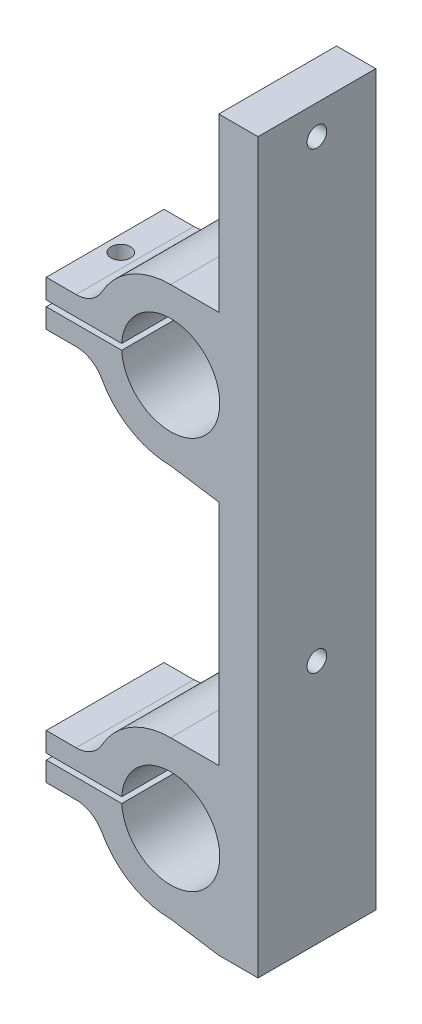
ISO-10303-21;
HEADER;
FILE_DESCRIPTION(('STEP AP214'),'2;1');
FILE_NAME('part.step','',(''),(''),'','','');
FILE_SCHEMA(('AUTOMOTIVE_DESIGN { 1 0 10303 214 1 1 1 1 }'));
ENDSEC;
DATA;
#1=APPLICATION_CONTEXT('core data for automotive mechanical design processes');
#2=APPLICATION_PROTOCOL_DEFINITION('international standard','automotive_design',2000,#1);
#3=PRODUCT_CONTEXT('',#1,'mechanical');
#4=PRODUCT('Part','Part','',(#3));
#5=PRODUCT_RELATED_PRODUCT_CATEGORY('part','',(#4));
#6=PRODUCT_DEFINITION_FORMATION('','',#4);
#7=PRODUCT_DEFINITION_CONTEXT('part definition',#1,'design');
#8=PRODUCT_DEFINITION('design','',#6,#7);
#9=PRODUCT_DEFINITION_SHAPE('','',#8);
#10=(LENGTH_UNIT() NAMED_UNIT(*) SI_UNIT(.MILLI.,.METRE.));
#11=(NAMED_UNIT(*) PLANE_ANGLE_UNIT() SI_UNIT($,.RADIAN.));
#12=(NAMED_UNIT(*) SI_UNIT($,.STERADIAN.) SOLID_ANGLE_UNIT());
#13=UNCERTAINTY_MEASURE_WITH_UNIT(LENGTH_MEASURE(1.E-05),#10,'distance_accuracy_value','');
#14=(GEOMETRIC_REPRESENTATION_CONTEXT(3) GLOBAL_UNCERTAINTY_ASSIGNED_CONTEXT((#13)) GLOBAL_UNIT_ASSIGNED_CONTEXT((#10,
#11,#12)) REPRESENTATION_CONTEXT('',''));
#15=CARTESIAN_POINT('',(0.,0.,0.));
#16=DIRECTION('',(0.,0.,1.));
#17=DIRECTION('',(1.,0.,0.));
#18=AXIS2_PLACEMENT_3D('',#15,#16,#17);
#19=CARTESIAN_POINT('',(-9.63898334888073,-5.3,12.));
#20=DIRECTION('',(0.,0.,-1.));
#21=DIRECTION('',(-1.,0.,0.));
#22=AXIS2_PLACEMENT_3D('',#19,#20,#21);
#23=CYLINDRICAL_SURFACE('',#22,3.);
#24=CARTESIAN_POINT('',(-9.63898334888073,-5.3,0.));
#25=DIRECTION('',(0.,0.,-1.));
#26=DIRECTION('',(-1.,0.,0.));
#27=AXIS2_PLACEMENT_3D('',#24,#25,#26);
#28=CIRCLE('',#27,3.);
#29=CARTESIAN_POINT('',(-9.63898334888073,-2.3,0.));
#30=VERTEX_POINT('',#29);
#31=CARTESIAN_POINT('',(-7.0101697082769,-3.85454545454545,0.));
#32=VERTEX_POINT('',#31);
#33=EDGE_CURVE('E270',#30,#32,#28,.T.);
#34=ORIENTED_EDGE('',*,*,#33,.T.);
#35=DIRECTION('',(0.,0.,-1.));
#36=VECTOR('',#35,1.);
#37=CARTESIAN_POINT('',(-7.0101697082769,-3.85454545454545,12.));
#38=LINE('',#37,#36);
#39=CARTESIAN_POINT('',(-7.0101697082769,-3.85454545454545,12.));
#40=VERTEX_POINT('',#39);
#41=EDGE_CURVE('E11',#40,#32,#38,.T.);
#42=ORIENTED_EDGE('',*,*,#41,.F.);
#43=CARTESIAN_POINT('',(-9.63898334888073,-5.3,12.));
#44=DIRECTION('',(0.,0.,-1.));
#45=DIRECTION('',(-1.,0.,0.));
#46=AXIS2_PLACEMENT_3D('',#43,#44,#45);
#47=CIRCLE('',#46,3.);
#48=CARTESIAN_POINT('',(-9.63898334888073,-2.3,12.));
#49=VERTEX_POINT('',#48);
#50=EDGE_CURVE('E332',#49,#40,#47,.T.);
#51=ORIENTED_EDGE('',*,*,#50,.F.);
#52=DIRECTION('',(0.,0.,-1.));
#53=VECTOR('',#52,1.);
#54=CARTESIAN_POINT('',(-9.63898334888073,-2.3,12.));
#55=LINE('',#54,#53);
#56=EDGE_CURVE('E266',#49,#30,#55,.T.);
#57=ORIENTED_EDGE('',*,*,#56,.T.);
#58=EDGE_LOOP('',(#34,#42,#51,#57));
#59=FACE_BOUND('',#58,.T.);
#60=ADVANCED_FACE('F35',(#59),#23,.F.);
#61=CARTESIAN_POINT('',(0.,0.,12.));
#62=DIRECTION('',(0.,0.,-1.));
#63=DIRECTION('',(-1.,0.,0.));
#64=AXIS2_PLACEMENT_3D('',#61,#62,#63);
#65=CYLINDRICAL_SURFACE('',#64,8.);
#66=CARTESIAN_POINT('',(0.,0.,0.));
#67=DIRECTION('',(0.,0.,1.));
#68=DIRECTION('',(1.,0.,0.));
#69=AXIS2_PLACEMENT_3D('',#66,#67,#68);
#70=CIRCLE('',#69,8.);
#71=CARTESIAN_POINT('',(0.,-8.,0.));
#72=VERTEX_POINT('',#71);
#73=EDGE_CURVE('E273',#32,#72,#70,.T.);
#74=ORIENTED_EDGE('',*,*,#73,.T.);
#75=DIRECTION('',(0.,0.,-1.));
#76=VECTOR('',#75,1.);
#77=CARTESIAN_POINT('',(0.,-8.,12.));
#78=LINE('',#77,#76);
#79=CARTESIAN_POINT('',(0.,-8.,12.));
#80=VERTEX_POINT('',#79);
#81=EDGE_CURVE('E44',#80,#72,#78,.T.);
#82=ORIENTED_EDGE('',*,*,#81,.F.);
#83=CARTESIAN_POINT('',(0.,0.,12.));
#84=DIRECTION('',(0.,0.,1.));
#85=DIRECTION('',(1.,0.,0.));
#86=AXIS2_PLACEMENT_3D('',#83,#84,#85);
#87=CIRCLE('',#86,8.);
#88=EDGE_CURVE('E164',#40,#80,#87,.T.);
#89=ORIENTED_EDGE('',*,*,#88,.F.);
#90=ORIENTED_EDGE('',*,*,#41,.T.);
#91=EDGE_LOOP('',(#74,#82,#89,#90));
#92=FACE_BOUND('',#91,.T.);
#93=ADVANCED_FACE('F507',(#92),#65,.T.);
#94=CARTESIAN_POINT('',(0.,-8.,12.));
#95=DIRECTION('',(0.152092330302128,0.988366289926598,0.));
#96=DIRECTION('',(-0.988366289926598,0.152092330302128,0.));
#97=AXIS2_PLACEMENT_3D('',#94,#95,#96);
#98=PLANE('',#97);
#99=DIRECTION('',(0.988366289926598,-0.152092330302128,0.));
#100=VECTOR('',#99,1.);
#101=CARTESIAN_POINT('',(0.,-8.,0.));
#102=LINE('',#101,#100);
#103=CARTESIAN_POINT('',(4.9,-8.7540245211477,0.));
#104=VERTEX_POINT('',#103);
#105=EDGE_CURVE('E276',#72,#104,#102,.T.);
#106=ORIENTED_EDGE('',*,*,#105,.T.);
#107=DIRECTION('',(0.,0.,-1.));
#108=VECTOR('',#107,1.);
#109=CARTESIAN_POINT('',(4.9,-8.7540245211477,12.));
#110=LINE('',#109,#108);
#111=CARTESIAN_POINT('',(4.9,-8.7540245211477,12.));
#112=VERTEX_POINT('',#111);
#113=EDGE_CURVE('E408',#112,#104,#110,.T.);
#114=ORIENTED_EDGE('',*,*,#113,.F.);
#115=DIRECTION('',(0.988366289926598,-0.152092330302128,0.));
#116=VECTOR('',#115,1.);
#117=CARTESIAN_POINT('',(0.,-8.,12.));
#118=LINE('',#117,#116);
#119=EDGE_CURVE('E417',#80,#112,#118,.T.);
#120=ORIENTED_EDGE('',*,*,#119,.F.);
#121=ORIENTED_EDGE('',*,*,#81,.T.);
#122=EDGE_LOOP('',(#106,#114,#120,#121));
#123=FACE_BOUND('',#122,.T.);
#124=ADVANCED_FACE('F415',(#123),#98,.F.);
#125=CARTESIAN_POINT('',(4.9,-31.,12.));
#126=DIRECTION('',(1.,0.,0.));
#127=DIRECTION('',(0.,1.,0.));
#128=AXIS2_PLACEMENT_3D('',#125,#126,#127);
#129=PLANE('',#128);
#130=CARTESIAN_POINT('',(4.9,-23.78,6.));
#131=DIRECTION('',(-1.,0.,0.));
#132=DIRECTION('',(0.,0.,1.));
#133=AXIS2_PLACEMENT_3D('',#130,#131,#132);
#134=CIRCLE('',#133,1.);
#135=CARTESIAN_POINT('',(4.9,-23.78,7.));
#136=VERTEX_POINT('',#135);
#137=EDGE_CURVE('E621',#136,#136,#134,.T.);
#138=ORIENTED_EDGE('',*,*,#137,.F.);
#139=EDGE_LOOP('',(#138));
#140=FACE_BOUND('',#139,.T.);
#141=DIRECTION('',(0.,-1.,0.));
#142=VECTOR('',#141,1.);
#143=CARTESIAN_POINT('',(4.9,-31.,0.));
#144=LINE('',#143,#142);
#145=CARTESIAN_POINT('',(4.9,-32.,0.));
#146=VERTEX_POINT('',#145);
#147=EDGE_CURVE('E279',#104,#146,#144,.T.);
#148=ORIENTED_EDGE('',*,*,#147,.T.);
#149=DIRECTION('',(0.,0.,-1.));
#150=VECTOR('',#149,1.);
#151=CARTESIAN_POINT('',(4.9,-32.,12.));
#152=LINE('',#151,#150);
#153=CARTESIAN_POINT('',(4.9,-32.,12.));
#154=VERTEX_POINT('',#153);
#155=EDGE_CURVE('E405',#154,#146,#152,.T.);
#156=ORIENTED_EDGE('',*,*,#155,.F.);
#157=DIRECTION('',(0.,-1.,0.));
#158=VECTOR('',#157,1.);
#159=CARTESIAN_POINT('',(4.9,-8.7540245211477,12.));
#160=LINE('',#159,#158);
#161=EDGE_CURVE('E434',#112,#154,#160,.T.);
#162=ORIENTED_EDGE('',*,*,#161,.F.);
#163=ORIENTED_EDGE('',*,*,#113,.T.);
#164=EDGE_LOOP('',(#148,#156,#162,#163));
#165=FACE_BOUND('',#164,.T.);
#166=ADVANCED_FACE('F425',(#140,#165),#129,.F.);
#167=CARTESIAN_POINT('',(0.,-32.,12.));
#168=DIRECTION('',(0.,-1.,0.));
#169=DIRECTION('',(1.,0.,0.));
#170=AXIS2_PLACEMENT_3D('',#167,#168,#169);
#171=PLANE('',#170);
#172=DIRECTION('',(-1.,0.,0.));
#173=VECTOR('',#172,1.);
#174=CARTESIAN_POINT('',(0.,-32.,0.));
#175=LINE('',#174,#173);
#176=CARTESIAN_POINT('',(0.,-32.,0.));
#177=VERTEX_POINT('',#176);
#178=EDGE_CURVE('E281',#146,#177,#175,.T.);
#179=ORIENTED_EDGE('',*,*,#178,.T.);
#180=DIRECTION('',(0.,0.,-1.));
#181=VECTOR('',#180,1.);
#182=CARTESIAN_POINT('',(0.,-32.,12.));
#183=LINE('',#182,#181);
#184=CARTESIAN_POINT('',(0.,-32.,12.));
#185=VERTEX_POINT('',#184);
#186=EDGE_CURVE('E402',#185,#177,#183,.T.);
#187=ORIENTED_EDGE('',*,*,#186,.F.);
#188=DIRECTION('',(-1.,0.,0.));
#189=VECTOR('',#188,1.);
#190=CARTESIAN_POINT('',(0.,-32.,12.));
#191=LINE('',#190,#189);
#192=EDGE_CURVE('E431',#154,#185,#191,.T.);
#193=ORIENTED_EDGE('',*,*,#192,.F.);
#194=ORIENTED_EDGE('',*,*,#155,.T.);
#195=EDGE_LOOP('',(#179,#187,#193,#194));
#196=FACE_BOUND('',#195,.T.);
#197=ADVANCED_FACE('F429',(#196),#171,.F.);
#198=CARTESIAN_POINT('',(0.,-40.,12.));
#199=DIRECTION('',(0.,0.,-1.));
#200=DIRECTION('',(-1.,0.,0.));
#201=AXIS2_PLACEMENT_3D('',#198,#199,#200);
#202=CYLINDRICAL_SURFACE('',#201,8.);
#203=CARTESIAN_POINT('',(0.,-40.,0.));
#204=DIRECTION('',(0.,0.,1.));
#205=DIRECTION('',(1.,0.,0.));
#206=AXIS2_PLACEMENT_3D('',#203,#204,#205);
#207=CIRCLE('',#206,8.);
#208=CARTESIAN_POINT('',(-7.01016970827689,-36.1454545454545,0.));
#209=VERTEX_POINT('',#208);
#210=EDGE_CURVE('E283',#177,#209,#207,.T.);
#211=ORIENTED_EDGE('',*,*,#210,.T.);
#212=DIRECTION('',(0.,0.,-1.));
#213=VECTOR('',#212,1.);
#214=CARTESIAN_POINT('',(-7.01016970827689,-36.1454545454545,12.));
#215=LINE('',#214,#213);
#216=CARTESIAN_POINT('',(-7.01016970827689,-36.1454545454545,12.));
#217=VERTEX_POINT('',#216);
#218=EDGE_CURVE('E399',#217,#209,#215,.T.);
#219=ORIENTED_EDGE('',*,*,#218,.F.);
#220=CARTESIAN_POINT('',(0.,-40.,12.));
#221=DIRECTION('',(0.,0.,1.));
#222=DIRECTION('',(1.,0.,0.));
#223=AXIS2_PLACEMENT_3D('',#220,#221,#222);
#224=CIRCLE('',#223,8.);
#225=EDGE_CURVE('E433',#185,#217,#224,.T.);
#226=ORIENTED_EDGE('',*,*,#225,.F.);
#227=ORIENTED_EDGE('',*,*,#186,.T.);
#228=EDGE_LOOP('',(#211,#219,#226,#227));
#229=FACE_BOUND('',#228,.T.);
#230=ADVANCED_FACE('F521',(#229),#202,.T.);
#231=CARTESIAN_POINT('',(-9.63898334888073,-34.7,12.));
#232=DIRECTION('',(0.,0.,-1.));
#233=DIRECTION('',(-1.,0.,0.));
#234=AXIS2_PLACEMENT_3D('',#231,#232,#233);
#235=CYLINDRICAL_SURFACE('',#234,3.);
#236=CARTESIAN_POINT('',(-9.63898334888073,-34.7,0.));
#237=DIRECTION('',(0.,0.,-1.));
#238=DIRECTION('',(1.,0.,0.));
#239=AXIS2_PLACEMENT_3D('',#236,#237,#238);
#240=CIRCLE('',#239,3.);
#241=CARTESIAN_POINT('',(-9.63898334888073,-37.7,0.));
#242=VERTEX_POINT('',#241);
#243=EDGE_CURVE('E285',#209,#242,#240,.T.);
#244=ORIENTED_EDGE('',*,*,#243,.T.);
#245=DIRECTION('',(0.,0.,-1.));
#246=VECTOR('',#245,1.);
#247=CARTESIAN_POINT('',(-9.63898334888073,-37.7,12.));
#248=LINE('',#247,#246);
#249=CARTESIAN_POINT('',(-9.63898334888073,-37.7,12.));
#250=VERTEX_POINT('',#249);
#251=EDGE_CURVE('E396',#250,#242,#248,.T.);
#252=ORIENTED_EDGE('',*,*,#251,.F.);
#253=CARTESIAN_POINT('',(-9.63898334888073,-34.7,12.));
#254=DIRECTION('',(0.,0.,-1.));
#255=DIRECTION('',(1.,0.,0.));
#256=AXIS2_PLACEMENT_3D('',#253,#254,#255);
#257=CIRCLE('',#256,3.);
#258=EDGE_CURVE('E436',#217,#250,#257,.T.);
#259=ORIENTED_EDGE('',*,*,#258,.F.);
#260=ORIENTED_EDGE('',*,*,#218,.T.);
#261=EDGE_LOOP('',(#244,#252,#259,#260));
#262=FACE_BOUND('',#261,.T.);
#263=ADVANCED_FACE('F524',(#262),#235,.F.);
#264=CARTESIAN_POINT('',(-9.63898334888073,-37.7,12.));
#265=DIRECTION('',(0.,-1.,0.));
#266=DIRECTION('',(0.,0.,-1.));
#267=AXIS2_PLACEMENT_3D('',#264,#265,#266);
#268=PLANE('',#267);
#269=DIRECTION('',(-1.,0.,0.));
#270=VECTOR('',#269,1.);
#271=CARTESIAN_POINT('',(-9.63898334888073,-37.7,0.));
#272=LINE('',#271,#270);
#273=CARTESIAN_POINT('',(-12.6811655814843,-37.7,0.));
#274=VERTEX_POINT('',#273);
#275=EDGE_CURVE('E287',#242,#274,#272,.T.);
#276=ORIENTED_EDGE('',*,*,#275,.T.);
#277=DIRECTION('',(0.,0.,-1.));
#278=VECTOR('',#277,1.);
#279=CARTESIAN_POINT('',(-12.6811655814843,-37.7,12.));
#280=LINE('',#279,#278);
#281=CARTESIAN_POINT('',(-12.6811655814843,-37.7,12.));
#282=VERTEX_POINT('',#281);
#283=EDGE_CURVE('E393',#282,#274,#280,.T.);
#284=ORIENTED_EDGE('',*,*,#283,.F.);
#285=DIRECTION('',(-1.,0.,0.));
#286=VECTOR('',#285,1.);
#287=CARTESIAN_POINT('',(-9.63898334888073,-37.7,12.));
#288=LINE('',#287,#286);
#289=EDGE_CURVE('E442',#250,#282,#288,.T.);
#290=ORIENTED_EDGE('',*,*,#289,.F.);
#291=ORIENTED_EDGE('',*,*,#251,.T.);
#292=EDGE_LOOP('',(#276,#284,#290,#291));
#293=FACE_BOUND('',#292,.T.);
#294=ADVANCED_FACE('F528',(#293),#268,.F.);
#295=CARTESIAN_POINT('',(-12.6811655814843,-37.7,12.));
#296=DIRECTION('',(1.,0.,0.));
#297=DIRECTION('',(0.,0.,-1.));
#298=AXIS2_PLACEMENT_3D('',#295,#296,#297);
#299=PLANE('',#298);
#300=DIRECTION('',(0.,-1.,0.));
#301=VECTOR('',#300,1.);
#302=CARTESIAN_POINT('',(-12.6811655814843,-37.7,0.));
#303=LINE('',#302,#301);
#304=CARTESIAN_POINT('',(-12.6811655814843,-39.7,0.));
#305=VERTEX_POINT('',#304);
#306=EDGE_CURVE('E289',#274,#305,#303,.T.);
#307=ORIENTED_EDGE('',*,*,#306,.T.);
#308=DIRECTION('',(0.,0.,-1.));
#309=VECTOR('',#308,1.);
#310=CARTESIAN_POINT('',(-12.6811655814843,-39.7,12.));
#311=LINE('',#310,#309);
#312=CARTESIAN_POINT('',(-12.6811655814843,-39.7,12.));
#313=VERTEX_POINT('',#312);
#314=EDGE_CURVE('E390',#313,#305,#311,.T.);
#315=ORIENTED_EDGE('',*,*,#314,.F.);
#316=DIRECTION('',(0.,-1.,0.));
#317=VECTOR('',#316,1.);
#318=CARTESIAN_POINT('',(-12.6811655814843,-37.7,12.));
#319=LINE('',#318,#317);
#320=EDGE_CURVE('E444',#282,#313,#319,.T.);
#321=ORIENTED_EDGE('',*,*,#320,.F.);
#322=ORIENTED_EDGE('',*,*,#283,.T.);
#323=EDGE_LOOP('',(#307,#315,#321,#322));
#324=FACE_BOUND('',#323,.T.);
#325=ADVANCED_FACE('F532',(#324),#299,.F.);
#326=CARTESIAN_POINT('',(-4.99099188538711,-39.7,12.));
#327=DIRECTION('',(0.,1.,0.));
#328=DIRECTION('',(0.,0.,1.));
#329=AXIS2_PLACEMENT_3D('',#326,#327,#328);
#330=PLANE('',#329);
#331=DIRECTION('',(1.,0.,0.));
#332=VECTOR('',#331,1.);
#333=CARTESIAN_POINT('',(-4.99099188538711,-39.7,0.));
#334=LINE('',#333,#332);
#335=CARTESIAN_POINT('',(-4.99099188538711,-39.7,0.));
#336=VERTEX_POINT('',#335);
#337=EDGE_CURVE('E291',#305,#336,#334,.T.);
#338=ORIENTED_EDGE('',*,*,#337,.T.);
#339=DIRECTION('',(0.,0.,-1.));
#340=VECTOR('',#339,1.);
#341=CARTESIAN_POINT('',(-4.99099188538711,-39.7,12.));
#342=LINE('',#341,#340);
#343=CARTESIAN_POINT('',(-4.99099188538711,-39.7,12.));
#344=VERTEX_POINT('',#343);
#345=EDGE_CURVE('E387',#344,#336,#342,.T.);
#346=ORIENTED_EDGE('',*,*,#345,.F.);
#347=DIRECTION('',(1.,0.,0.));
#348=VECTOR('',#347,1.);
#349=CARTESIAN_POINT('',(-4.99099188538711,-39.7,12.));
#350=LINE('',#349,#348);
#351=EDGE_CURVE('E446',#313,#344,#350,.T.);
#352=ORIENTED_EDGE('',*,*,#351,.F.);
#353=ORIENTED_EDGE('',*,*,#314,.T.);
#354=EDGE_LOOP('',(#338,#346,#352,#353));
#355=FACE_BOUND('',#354,.T.);
#356=ADVANCED_FACE('F536',(#355),#330,.F.);
#357=CARTESIAN_POINT('',(0.,-40.,12.));
#358=DIRECTION('',(0.,0.,-1.));
#359=DIRECTION('',(-1.,0.,0.));
#360=AXIS2_PLACEMENT_3D('',#357,#358,#359);
#361=CYLINDRICAL_SURFACE('',#360,5.);
#362=CARTESIAN_POINT('',(0.,-40.,0.));
#363=DIRECTION('',(0.,0.,-1.));
#364=DIRECTION('',(1.,0.,0.));
#365=AXIS2_PLACEMENT_3D('',#362,#363,#364);
#366=CIRCLE('',#365,5.);
#367=CARTESIAN_POINT('',(-4.99099188538711,-40.3,0.));
#368=VERTEX_POINT('',#367);
#369=EDGE_CURVE('E293',#336,#368,#366,.T.);
#370=ORIENTED_EDGE('',*,*,#369,.T.);
#371=DIRECTION('',(0.,0.,-1.));
#372=VECTOR('',#371,1.);
#373=CARTESIAN_POINT('',(-4.99099188538711,-40.3,12.));
#374=LINE('',#373,#372);
#375=CARTESIAN_POINT('',(-4.99099188538711,-40.3,12.));
#376=VERTEX_POINT('',#375);
#377=EDGE_CURVE('E384',#376,#368,#374,.T.);
#378=ORIENTED_EDGE('',*,*,#377,.F.);
#379=CARTESIAN_POINT('',(0.,-40.,12.));
#380=DIRECTION('',(0.,0.,-1.));
#381=DIRECTION('',(1.,0.,0.));
#382=AXIS2_PLACEMENT_3D('',#379,#380,#381);
#383=CIRCLE('',#382,5.);
#384=EDGE_CURVE('E448',#344,#376,#383,.T.);
#385=ORIENTED_EDGE('',*,*,#384,.F.);
#386=ORIENTED_EDGE('',*,*,#345,.T.);
#387=EDGE_LOOP('',(#370,#378,#385,#386));
#388=FACE_BOUND('',#387,.T.);
#389=ADVANCED_FACE('F540',(#388),#361,.F.);
#390=CARTESIAN_POINT('',(-4.99099188538711,-40.3,12.));
#391=DIRECTION('',(0.,-1.,0.));
#392=DIRECTION('',(0.,0.,-1.));
#393=AXIS2_PLACEMENT_3D('',#390,#391,#392);
#394=PLANE('',#393);
#395=DIRECTION('',(-1.,0.,0.));
#396=VECTOR('',#395,1.);
#397=CARTESIAN_POINT('',(-4.99099188538711,-40.3,0.));
#398=LINE('',#397,#396);
#399=CARTESIAN_POINT('',(-12.6811655814843,-40.3,0.));
#400=VERTEX_POINT('',#399);
#401=EDGE_CURVE('E295',#368,#400,#398,.T.);
#402=ORIENTED_EDGE('',*,*,#401,.T.);
#403=DIRECTION('',(0.,0.,-1.));
#404=VECTOR('',#403,1.);
#405=CARTESIAN_POINT('',(-12.6811655814843,-40.3,12.));
#406=LINE('',#405,#404);
#407=CARTESIAN_POINT('',(-12.6811655814843,-40.3,12.));
#408=VERTEX_POINT('',#407);
#409=EDGE_CURVE('E381',#408,#400,#406,.T.);
#410=ORIENTED_EDGE('',*,*,#409,.F.);
#411=DIRECTION('',(-1.,0.,0.));
#412=VECTOR('',#411,1.);
#413=CARTESIAN_POINT('',(-4.99099188538711,-40.3,12.));
#414=LINE('',#413,#412);
#415=EDGE_CURVE('E450',#376,#408,#414,.T.);
#416=ORIENTED_EDGE('',*,*,#415,.F.);
#417=ORIENTED_EDGE('',*,*,#377,.T.);
#418=EDGE_LOOP('',(#402,#410,#416,#417));
#419=FACE_BOUND('',#418,.T.);
#420=ADVANCED_FACE('F544',(#419),#394,.F.);
#421=CARTESIAN_POINT('',(-12.6811655814843,-40.3,12.));
#422=DIRECTION('',(1.,0.,0.));
#423=DIRECTION('',(0.,0.,-1.));
#424=AXIS2_PLACEMENT_3D('',#421,#422,#423);
#425=PLANE('',#424);
#426=DIRECTION('',(0.,-1.,0.));
#427=VECTOR('',#426,1.);
#428=CARTESIAN_POINT('',(-12.6811655814843,-40.3,0.));
#429=LINE('',#428,#427);
#430=CARTESIAN_POINT('',(-12.6811655814843,-42.3,0.));
#431=VERTEX_POINT('',#430);
#432=EDGE_CURVE('E297',#400,#431,#429,.T.);
#433=ORIENTED_EDGE('',*,*,#432,.T.);
#434=DIRECTION('',(0.,0.,-1.));
#435=VECTOR('',#434,1.);
#436=CARTESIAN_POINT('',(-12.6811655814843,-42.3,12.));
#437=LINE('',#436,#435);
#438=CARTESIAN_POINT('',(-12.6811655814843,-42.3,12.));
#439=VERTEX_POINT('',#438);
#440=EDGE_CURVE('E378',#439,#431,#437,.T.);
#441=ORIENTED_EDGE('',*,*,#440,.F.);
#442=DIRECTION('',(0.,-1.,0.));
#443=VECTOR('',#442,1.);
#444=CARTESIAN_POINT('',(-12.6811655814843,-40.3,12.));
#445=LINE('',#444,#443);
#446=EDGE_CURVE('E452',#408,#439,#445,.T.);
#447=ORIENTED_EDGE('',*,*,#446,.F.);
#448=ORIENTED_EDGE('',*,*,#409,.T.);
#449=EDGE_LOOP('',(#433,#441,#447,#448));
#450=FACE_BOUND('',#449,.T.);
#451=ADVANCED_FACE('F548',(#450),#425,.F.);
#452=CARTESIAN_POINT('',(-9.63898334888073,-42.3,12.));
#453=DIRECTION('',(0.,1.,0.));
#454=DIRECTION('',(0.,0.,1.));
#455=AXIS2_PLACEMENT_3D('',#452,#453,#454);
#456=PLANE('',#455);
#457=DIRECTION('',(1.,0.,0.));
#458=VECTOR('',#457,1.);
#459=CARTESIAN_POINT('',(-9.63898334888073,-42.3,0.));
#460=LINE('',#459,#458);
#461=CARTESIAN_POINT('',(-9.63898334888073,-42.3,0.));
#462=VERTEX_POINT('',#461);
#463=EDGE_CURVE('E299',#431,#462,#460,.T.);
#464=ORIENTED_EDGE('',*,*,#463,.T.);
#465=DIRECTION('',(0.,0.,-1.));
#466=VECTOR('',#465,1.);
#467=CARTESIAN_POINT('',(-9.63898334888073,-42.3,12.));
#468=LINE('',#467,#466);
#469=CARTESIAN_POINT('',(-9.63898334888073,-42.3,12.));
#470=VERTEX_POINT('',#469);
#471=EDGE_CURVE('E375',#470,#462,#468,.T.);
#472=ORIENTED_EDGE('',*,*,#471,.F.);
#473=DIRECTION('',(1.,0.,0.));
#474=VECTOR('',#473,1.);
#475=CARTESIAN_POINT('',(-9.63898334888073,-42.3,12.));
#476=LINE('',#475,#474);
#477=EDGE_CURVE('E454',#439,#470,#476,.T.);
#478=ORIENTED_EDGE('',*,*,#477,.F.);
#479=ORIENTED_EDGE('',*,*,#440,.T.);
#480=EDGE_LOOP('',(#464,#472,#478,#479));
#481=FACE_BOUND('',#480,.T.);
#482=ADVANCED_FACE('F552',(#481),#456,.F.);
#483=CARTESIAN_POINT('',(-9.63898334888073,-45.3,12.));
#484=DIRECTION('',(0.,0.,-1.));
#485=DIRECTION('',(-1.,0.,0.));
#486=AXIS2_PLACEMENT_3D('',#483,#484,#485);
#487=CYLINDRICAL_SURFACE('',#486,3.);
#488=CARTESIAN_POINT('',(-9.63898334888073,-45.3,0.));
#489=DIRECTION('',(0.,0.,-1.));
#490=DIRECTION('',(-1.,0.,0.));
#491=AXIS2_PLACEMENT_3D('',#488,#489,#490);
#492=CIRCLE('',#491,3.);
#493=CARTESIAN_POINT('',(-7.01016970827689,-43.8545454545455,0.));
#494=VERTEX_POINT('',#493);
#495=EDGE_CURVE('E301',#462,#494,#492,.T.);
#496=ORIENTED_EDGE('',*,*,#495,.T.);
#497=DIRECTION('',(0.,0.,-1.));
#498=VECTOR('',#497,1.);
#499=CARTESIAN_POINT('',(-7.01016970827689,-43.8545454545455,12.));
#500=LINE('',#499,#498);
#501=CARTESIAN_POINT('',(-7.01016970827689,-43.8545454545455,12.));
#502=VERTEX_POINT('',#501);
#503=EDGE_CURVE('E372',#502,#494,#500,.T.);
#504=ORIENTED_EDGE('',*,*,#503,.F.);
#505=CARTESIAN_POINT('',(-9.63898334888073,-45.3,12.));
#506=DIRECTION('',(0.,0.,-1.));
#507=DIRECTION('',(-1.,0.,0.));
#508=AXIS2_PLACEMENT_3D('',#505,#506,#507);
#509=CIRCLE('',#508,3.);
#510=EDGE_CURVE('E456',#470,#502,#509,.T.);
#511=ORIENTED_EDGE('',*,*,#510,.F.);
#512=ORIENTED_EDGE('',*,*,#471,.T.);
#513=EDGE_LOOP('',(#496,#504,#511,#512));
#514=FACE_BOUND('',#513,.T.);
#515=ADVANCED_FACE('F556',(#514),#487,.F.);
#516=CARTESIAN_POINT('',(0.,-40.,12.));
#517=DIRECTION('',(0.,0.,-1.));
#518=DIRECTION('',(-1.,0.,0.));
#519=AXIS2_PLACEMENT_3D('',#516,#517,#518);
#520=CYLINDRICAL_SURFACE('',#519,8.);
#521=CARTESIAN_POINT('',(0.,-40.,0.));
#522=DIRECTION('',(0.,0.,1.));
#523=DIRECTION('',(1.,0.,0.));
#524=AXIS2_PLACEMENT_3D('',#521,#522,#523);
#525=CIRCLE('',#524,8.);
#526=CARTESIAN_POINT('',(0.,-48.,0.));
#527=VERTEX_POINT('',#526);
#528=EDGE_CURVE('E303',#494,#527,#525,.T.);
#529=ORIENTED_EDGE('',*,*,#528,.T.);
#530=DIRECTION('',(0.,0.,-1.));
#531=VECTOR('',#530,1.);
#532=CARTESIAN_POINT('',(0.,-48.,12.));
#533=LINE('',#532,#531);
#534=CARTESIAN_POINT('',(0.,-48.,12.));
#535=VERTEX_POINT('',#534);
#536=EDGE_CURVE('E369',#535,#527,#533,.T.);
#537=ORIENTED_EDGE('',*,*,#536,.F.);
#538=CARTESIAN_POINT('',(0.,-40.,12.));
#539=DIRECTION('',(0.,0.,1.));
#540=DIRECTION('',(1.,0.,0.));
#541=AXIS2_PLACEMENT_3D('',#538,#539,#540);
#542=CIRCLE('',#541,8.);
#543=EDGE_CURVE('E458',#502,#535,#542,.T.);
#544=ORIENTED_EDGE('',*,*,#543,.F.);
#545=ORIENTED_EDGE('',*,*,#503,.T.);
#546=EDGE_LOOP('',(#529,#537,#544,#545));
#547=FACE_BOUND('',#546,.T.);
#548=ADVANCED_FACE('F560',(#547),#520,.T.);
#549=CARTESIAN_POINT('',(0.,-48.,12.));
#550=DIRECTION('',(0.152092330302128,0.988366289926598,0.));
#551=DIRECTION('',(-0.988366289926598,0.152092330302128,0.));
#552=AXIS2_PLACEMENT_3D('',#549,#550,#551);
#553=PLANE('',#552);
#554=DIRECTION('',(0.988366289926598,-0.152092330302128,0.));
#555=VECTOR('',#554,1.);
#556=CARTESIAN_POINT('',(0.,-48.,0.));
#557=LINE('',#556,#555);
#558=CARTESIAN_POINT('',(4.9,-48.7540245211477,0.));
#559=VERTEX_POINT('',#558);
#560=EDGE_CURVE('E305',#527,#559,#557,.T.);
#561=ORIENTED_EDGE('',*,*,#560,.T.);
#562=DIRECTION('',(0.,0.,-1.));
#563=VECTOR('',#562,1.);
#564=CARTESIAN_POINT('',(4.9,-48.7540245211477,12.));
#565=LINE('',#564,#563);
#566=CARTESIAN_POINT('',(4.9,-48.7540245211477,12.));
#567=VERTEX_POINT('',#566);
#568=EDGE_CURVE('E366',#567,#559,#565,.T.);
#569=ORIENTED_EDGE('',*,*,#568,.F.);
#570=DIRECTION('',(0.988366289926598,-0.152092330302128,0.));
#571=VECTOR('',#570,1.);
#572=CARTESIAN_POINT('',(0.,-48.,12.));
#573=LINE('',#572,#571);
#574=EDGE_CURVE('E460',#535,#567,#573,.T.);
#575=ORIENTED_EDGE('',*,*,#574,.F.);
#576=ORIENTED_EDGE('',*,*,#536,.T.);
#577=EDGE_LOOP('',(#561,#569,#575,#576));
#578=FACE_BOUND('',#577,.T.);
#579=ADVANCED_FACE('F564',(#578),#553,.F.);
#580=CARTESIAN_POINT('',(4.9,-48.7540245211477,12.));
#581=DIRECTION('',(0.,1.,0.));
#582=DIRECTION('',(-1.,0.,0.));
#583=AXIS2_PLACEMENT_3D('',#580,#581,#582);
#584=PLANE('',#583);
#585=DIRECTION('',(1.,0.,0.));
#586=VECTOR('',#585,1.);
#587=CARTESIAN_POINT('',(4.9,-48.7540245211477,0.));
#588=LINE('',#587,#586);
#589=CARTESIAN_POINT('',(8.90000000000001,-48.7540245211477,0.));
#590=VERTEX_POINT('',#589);
#591=EDGE_CURVE('E307',#559,#590,#588,.T.);
#592=ORIENTED_EDGE('',*,*,#591,.T.);
#593=DIRECTION('',(0.,0.,-1.));
#594=VECTOR('',#593,1.);
#595=CARTESIAN_POINT('',(8.90000000000001,-48.7540245211477,12.));
#596=LINE('',#595,#594);
#597=CARTESIAN_POINT('',(8.90000000000001,-48.7540245211477,12.));
#598=VERTEX_POINT('',#597);
#599=EDGE_CURVE('E363',#598,#590,#596,.T.);
#600=ORIENTED_EDGE('',*,*,#599,.F.);
#601=DIRECTION('',(1.,0.,0.));
#602=VECTOR('',#601,1.);
#603=CARTESIAN_POINT('',(4.9,-48.7540245211477,12.));
#604=LINE('',#603,#602);
#605=EDGE_CURVE('E462',#567,#598,#604,.T.);
#606=ORIENTED_EDGE('',*,*,#605,.F.);
#607=ORIENTED_EDGE('',*,*,#568,.T.);
#608=EDGE_LOOP('',(#592,#600,#606,#607));
#609=FACE_BOUND('',#608,.T.);
#610=ADVANCED_FACE('F568',(#609),#584,.F.);
#611=CARTESIAN_POINT('',(8.9,25.5,12.));
#612=DIRECTION('',(-1.,0.,0.));
#613=DIRECTION('',(0.,-1.,0.));
#614=AXIS2_PLACEMENT_3D('',#611,#612,#613);
#615=PLANE('',#614);
#616=CARTESIAN_POINT('',(8.9,-23.78,6.));
#617=DIRECTION('',(-1.,0.,0.));
#618=DIRECTION('',(0.,0.,1.));
#619=AXIS2_PLACEMENT_3D('',#616,#617,#618);
#620=CIRCLE('',#619,1.);
#621=CARTESIAN_POINT('',(8.9,-23.78,7.));
#622=VERTEX_POINT('',#621);
#623=EDGE_CURVE('E626',#622,#622,#620,.T.);
#624=ORIENTED_EDGE('',*,*,#623,.T.);
#625=EDGE_LOOP('',(#624));
#626=FACE_BOUND('',#625,.T.);
#627=CARTESIAN_POINT('',(8.9,22.5,6.));
#628=DIRECTION('',(-1.,0.,0.));
#629=DIRECTION('',(0.,0.,1.));
#630=AXIS2_PLACEMENT_3D('',#627,#628,#629);
#631=CIRCLE('',#630,1.);
#632=CARTESIAN_POINT('',(8.9,22.5,7.));
#633=VERTEX_POINT('',#632);
#634=EDGE_CURVE('E274',#633,#633,#631,.T.);
#635=ORIENTED_EDGE('',*,*,#634,.T.);
#636=EDGE_LOOP('',(#635));
#637=FACE_BOUND('',#636,.T.);
#638=DIRECTION('',(0.,1.,0.));
#639=VECTOR('',#638,1.);
#640=CARTESIAN_POINT('',(8.9,25.5,0.));
#641=LINE('',#640,#639);
#642=CARTESIAN_POINT('',(8.9,25.5,0.));
#643=VERTEX_POINT('',#642);
#644=EDGE_CURVE('E309',#590,#643,#641,.T.);
#645=ORIENTED_EDGE('',*,*,#644,.T.);
#646=DIRECTION('',(0.,0.,-1.));
#647=VECTOR('',#646,1.);
#648=CARTESIAN_POINT('',(8.9,25.5,12.));
#649=LINE('',#648,#647);
#650=CARTESIAN_POINT('',(8.9,25.5,12.));
#651=VERTEX_POINT('',#650);
#652=EDGE_CURVE('E360',#651,#643,#649,.T.);
#653=ORIENTED_EDGE('',*,*,#652,.F.);
#654=DIRECTION('',(0.,1.,0.));
#655=VECTOR('',#654,1.);
#656=CARTESIAN_POINT('',(8.9,25.5,12.));
#657=LINE('',#656,#655);
#658=EDGE_CURVE('E464',#598,#651,#657,.T.);
#659=ORIENTED_EDGE('',*,*,#658,.F.);
#660=ORIENTED_EDGE('',*,*,#599,.T.);
#661=EDGE_LOOP('',(#645,#653,#659,#660));
#662=FACE_BOUND('',#661,.T.);
#663=ADVANCED_FACE('F572',(#626,#637,#662),#615,.F.);
#664=CARTESIAN_POINT('',(4.9,25.5,12.));
#665=DIRECTION('',(0.,-1.,0.));
#666=DIRECTION('',(0.,0.,-1.));
#667=AXIS2_PLACEMENT_3D('',#664,#665,#666);
#668=PLANE('',#667);
#669=DIRECTION('',(-1.,0.,0.));
#670=VECTOR('',#669,1.);
#671=CARTESIAN_POINT('',(4.9,25.5,0.));
#672=LINE('',#671,#670);
#673=CARTESIAN_POINT('',(4.9,25.5,0.));
#674=VERTEX_POINT('',#673);
#675=EDGE_CURVE('E311',#643,#674,#672,.T.);
#676=ORIENTED_EDGE('',*,*,#675,.T.);
#677=DIRECTION('',(0.,0.,-1.));
#678=VECTOR('',#677,1.);
#679=CARTESIAN_POINT('',(4.9,25.5,12.));
#680=LINE('',#679,#678);
#681=CARTESIAN_POINT('',(4.9,25.5,12.));
#682=VERTEX_POINT('',#681);
#683=EDGE_CURVE('E357',#682,#674,#680,.T.);
#684=ORIENTED_EDGE('',*,*,#683,.F.);
#685=DIRECTION('',(-1.,0.,0.));
#686=VECTOR('',#685,1.);
#687=CARTESIAN_POINT('',(4.9,25.5,12.));
#688=LINE('',#687,#686);
#689=EDGE_CURVE('E466',#651,#682,#688,.T.);
#690=ORIENTED_EDGE('',*,*,#689,.F.);
#691=ORIENTED_EDGE('',*,*,#652,.T.);
#692=EDGE_LOOP('',(#676,#684,#690,#691));
#693=FACE_BOUND('',#692,.T.);
#694=ADVANCED_FACE('F576',(#693),#668,.F.);
#695=CARTESIAN_POINT('',(4.9,25.5,12.));
#696=DIRECTION('',(1.,0.,0.));
#697=DIRECTION('',(0.,0.,-1.));
#698=AXIS2_PLACEMENT_3D('',#695,#696,#697);
#699=PLANE('',#698);
#700=CARTESIAN_POINT('',(4.9,22.5,6.));
#701=DIRECTION('',(-1.,0.,0.));
#702=DIRECTION('',(0.,0.,1.));
#703=AXIS2_PLACEMENT_3D('',#700,#701,#702);
#704=CIRCLE('',#703,1.);
#705=CARTESIAN_POINT('',(4.9,22.5,7.));
#706=VERTEX_POINT('',#705);
#707=EDGE_CURVE('E629',#706,#706,#704,.T.);
#708=ORIENTED_EDGE('',*,*,#707,.F.);
#709=EDGE_LOOP('',(#708));
#710=FACE_BOUND('',#709,.T.);
#711=DIRECTION('',(0.,-1.,0.));
#712=VECTOR('',#711,1.);
#713=CARTESIAN_POINT('',(4.9,25.5,0.));
#714=LINE('',#713,#712);
#715=CARTESIAN_POINT('',(4.9,8.,0.));
#716=VERTEX_POINT('',#715);
#717=EDGE_CURVE('E313',#674,#716,#714,.T.);
#718=ORIENTED_EDGE('',*,*,#717,.T.);
#719=DIRECTION('',(0.,0.,-1.));
#720=VECTOR('',#719,1.);
#721=CARTESIAN_POINT('',(4.9,8.,12.));
#722=LINE('',#721,#720);
#723=CARTESIAN_POINT('',(4.9,8.,12.));
#724=VERTEX_POINT('',#723);
#725=EDGE_CURVE('E354',#724,#716,#722,.T.);
#726=ORIENTED_EDGE('',*,*,#725,.F.);
#727=DIRECTION('',(0.,-1.,0.));
#728=VECTOR('',#727,1.);
#729=CARTESIAN_POINT('',(4.9,25.5,12.));
#730=LINE('',#729,#728);
#731=EDGE_CURVE('E468',#682,#724,#730,.T.);
#732=ORIENTED_EDGE('',*,*,#731,.F.);
#733=ORIENTED_EDGE('',*,*,#683,.T.);
#734=EDGE_LOOP('',(#718,#726,#732,#733));
#735=FACE_BOUND('',#734,.T.);
#736=ADVANCED_FACE('F580',(#710,#735),#699,.F.);
#737=CARTESIAN_POINT('',(0.,8.,12.));
#738=DIRECTION('',(0.,-1.,0.));
#739=DIRECTION('',(0.,0.,-1.));
#740=AXIS2_PLACEMENT_3D('',#737,#738,#739);
#741=PLANE('',#740);
#742=DIRECTION('',(-1.,0.,0.));
#743=VECTOR('',#742,1.);
#744=CARTESIAN_POINT('',(0.,8.,0.));
#745=LINE('',#744,#743);
#746=CARTESIAN_POINT('',(0.,8.,0.));
#747=VERTEX_POINT('',#746);
#748=EDGE_CURVE('E315',#716,#747,#745,.T.);
#749=ORIENTED_EDGE('',*,*,#748,.T.);
#750=DIRECTION('',(0.,0.,-1.));
#751=VECTOR('',#750,1.);
#752=CARTESIAN_POINT('',(0.,8.,12.));
#753=LINE('',#752,#751);
#754=CARTESIAN_POINT('',(0.,8.,12.));
#755=VERTEX_POINT('',#754);
#756=EDGE_CURVE('E351',#755,#747,#753,.T.);
#757=ORIENTED_EDGE('',*,*,#756,.F.);
#758=DIRECTION('',(-1.,0.,0.));
#759=VECTOR('',#758,1.);
#760=CARTESIAN_POINT('',(0.,8.,12.));
#761=LINE('',#760,#759);
#762=EDGE_CURVE('E470',#724,#755,#761,.T.);
#763=ORIENTED_EDGE('',*,*,#762,.F.);
#764=ORIENTED_EDGE('',*,*,#725,.T.);
#765=EDGE_LOOP('',(#749,#757,#763,#764));
#766=FACE_BOUND('',#765,.T.);
#767=ADVANCED_FACE('F584',(#766),#741,.F.);
#768=CARTESIAN_POINT('',(0.,0.,12.));
#769=DIRECTION('',(0.,0.,-1.));
#770=DIRECTION('',(-1.,0.,0.));
#771=AXIS2_PLACEMENT_3D('',#768,#769,#770);
#772=CYLINDRICAL_SURFACE('',#771,8.);
#773=CARTESIAN_POINT('',(0.,0.,0.));
#774=DIRECTION('',(0.,0.,1.));
#775=DIRECTION('',(1.,0.,0.));
#776=AXIS2_PLACEMENT_3D('',#773,#774,#775);
#777=CIRCLE('',#776,8.);
#778=CARTESIAN_POINT('',(-7.0101697082769,3.85454545454545,0.));
#779=VERTEX_POINT('',#778);
#780=EDGE_CURVE('E317',#747,#779,#777,.T.);
#781=ORIENTED_EDGE('',*,*,#780,.T.);
#782=DIRECTION('',(0.,0.,-1.));
#783=VECTOR('',#782,1.);
#784=CARTESIAN_POINT('',(-7.0101697082769,3.85454545454545,12.));
#785=LINE('',#784,#783);
#786=CARTESIAN_POINT('',(-7.0101697082769,3.85454545454545,12.));
#787=VERTEX_POINT('',#786);
#788=EDGE_CURVE('E348',#787,#779,#785,.T.);
#789=ORIENTED_EDGE('',*,*,#788,.F.);
#790=CARTESIAN_POINT('',(0.,0.,12.));
#791=DIRECTION('',(0.,0.,1.));
#792=DIRECTION('',(1.,0.,0.));
#793=AXIS2_PLACEMENT_3D('',#790,#791,#792);
#794=CIRCLE('',#793,8.);
#795=EDGE_CURVE('E472',#755,#787,#794,.T.);
#796=ORIENTED_EDGE('',*,*,#795,.F.);
#797=ORIENTED_EDGE('',*,*,#756,.T.);
#798=EDGE_LOOP('',(#781,#789,#796,#797));
#799=FACE_BOUND('',#798,.T.);
#800=ADVANCED_FACE('F588',(#799),#772,.T.);
#801=CARTESIAN_POINT('',(-9.63898334888073,5.3,12.));
#802=DIRECTION('',(0.,0.,-1.));
#803=DIRECTION('',(-1.,0.,0.));
#804=AXIS2_PLACEMENT_3D('',#801,#802,#803);
#805=CYLINDRICAL_SURFACE('',#804,3.);
#806=CARTESIAN_POINT('',(-9.63898334888073,5.3,0.));
#807=DIRECTION('',(0.,0.,-1.));
#808=DIRECTION('',(1.,0.,0.));
#809=AXIS2_PLACEMENT_3D('',#806,#807,#808);
#810=CIRCLE('',#809,3.);
#811=CARTESIAN_POINT('',(-9.63898334888073,2.3,0.));
#812=VERTEX_POINT('',#811);
#813=EDGE_CURVE('E319',#779,#812,#810,.T.);
#814=ORIENTED_EDGE('',*,*,#813,.T.);
#815=DIRECTION('',(0.,0.,-1.));
#816=VECTOR('',#815,1.);
#817=CARTESIAN_POINT('',(-9.63898334888073,2.3,12.));
#818=LINE('',#817,#816);
#819=CARTESIAN_POINT('',(-9.63898334888073,2.3,12.));
#820=VERTEX_POINT('',#819);
#821=EDGE_CURVE('E345',#820,#812,#818,.T.);
#822=ORIENTED_EDGE('',*,*,#821,.F.);
#823=CARTESIAN_POINT('',(-9.63898334888073,5.3,12.));
#824=DIRECTION('',(0.,0.,-1.));
#825=DIRECTION('',(1.,0.,0.));
#826=AXIS2_PLACEMENT_3D('',#823,#824,#825);
#827=CIRCLE('',#826,3.);
#828=EDGE_CURVE('E474',#787,#820,#827,.T.);
#829=ORIENTED_EDGE('',*,*,#828,.F.);
#830=ORIENTED_EDGE('',*,*,#788,.T.);
#831=EDGE_LOOP('',(#814,#822,#829,#830));
#832=FACE_BOUND('',#831,.T.);
#833=ADVANCED_FACE('F592',(#832),#805,.F.);
#834=CARTESIAN_POINT('',(-9.63898334888073,2.3,12.));
#835=DIRECTION('',(0.,-1.,0.));
#836=DIRECTION('',(0.,0.,-1.));
#837=AXIS2_PLACEMENT_3D('',#834,#835,#836);
#838=PLANE('',#837);
#839=CARTESIAN_POINT('',(-11.0811655814843,2.3,6.));
#840=DIRECTION('',(0.,1.,0.));
#841=DIRECTION('',(0.,0.,1.));
#842=AXIS2_PLACEMENT_3D('',#839,#840,#841);
#843=CIRCLE('',#842,1.);
#844=CARTESIAN_POINT('',(-11.0811655814843,2.3,7.));
#845=VERTEX_POINT('',#844);
#846=EDGE_CURVE('E623',#845,#845,#843,.T.);
#847=ORIENTED_EDGE('',*,*,#846,.F.);
#848=EDGE_LOOP('',(#847));
#849=FACE_BOUND('',#848,.T.);
#850=DIRECTION('',(-1.,0.,0.));
#851=VECTOR('',#850,1.);
#852=CARTESIAN_POINT('',(-9.63898334888073,2.3,0.));
#853=LINE('',#852,#851);
#854=CARTESIAN_POINT('',(-12.6811655814843,2.3,0.));
#855=VERTEX_POINT('',#854);
#856=EDGE_CURVE('E321',#812,#855,#853,.T.);
#857=ORIENTED_EDGE('',*,*,#856,.T.);
#858=DIRECTION('',(0.,0.,-1.));
#859=VECTOR('',#858,1.);
#860=CARTESIAN_POINT('',(-12.6811655814843,2.3,12.));
#861=LINE('',#860,#859);
#862=CARTESIAN_POINT('',(-12.6811655814843,2.3,12.));
#863=VERTEX_POINT('',#862);
#864=EDGE_CURVE('E342',#863,#855,#861,.T.);
#865=ORIENTED_EDGE('',*,*,#864,.F.);
#866=DIRECTION('',(-1.,0.,0.));
#867=VECTOR('',#866,1.);
#868=CARTESIAN_POINT('',(-9.63898334888073,2.3,12.));
#869=LINE('',#868,#867);
#870=EDGE_CURVE('E476',#820,#863,#869,.T.);
#871=ORIENTED_EDGE('',*,*,#870,.F.);
#872=ORIENTED_EDGE('',*,*,#821,.T.);
#873=EDGE_LOOP('',(#857,#865,#871,#872));
#874=FACE_BOUND('',#873,.T.);
#875=ADVANCED_FACE('F596',(#849,#874),#838,.F.);
#876=CARTESIAN_POINT('',(-12.6811655814843,2.3,12.));
#877=DIRECTION('',(1.,0.,0.));
#878=DIRECTION('',(0.,0.,-1.));
#879=AXIS2_PLACEMENT_3D('',#876,#877,#878);
#880=PLANE('',#879);
#881=DIRECTION('',(0.,-1.,0.));
#882=VECTOR('',#881,1.);
#883=CARTESIAN_POINT('',(-12.6811655814843,2.3,0.));
#884=LINE('',#883,#882);
#885=CARTESIAN_POINT('',(-12.6811655814843,0.3,0.));
#886=VERTEX_POINT('',#885);
#887=EDGE_CURVE('E323',#855,#886,#884,.T.);
#888=ORIENTED_EDGE('',*,*,#887,.T.);
#889=DIRECTION('',(0.,0.,-1.));
#890=VECTOR('',#889,1.);
#891=CARTESIAN_POINT('',(-12.6811655814843,0.3,12.));
#892=LINE('',#891,#890);
#893=CARTESIAN_POINT('',(-12.6811655814843,0.3,12.));
#894=VERTEX_POINT('',#893);
#895=EDGE_CURVE('E339',#894,#886,#892,.T.);
#896=ORIENTED_EDGE('',*,*,#895,.F.);
#897=DIRECTION('',(0.,-1.,0.));
#898=VECTOR('',#897,1.);
#899=CARTESIAN_POINT('',(-12.6811655814843,2.3,12.));
#900=LINE('',#899,#898);
#901=EDGE_CURVE('E478',#863,#894,#900,.T.);
#902=ORIENTED_EDGE('',*,*,#901,.F.);
#903=ORIENTED_EDGE('',*,*,#864,.T.);
#904=EDGE_LOOP('',(#888,#896,#902,#903));
#905=FACE_BOUND('',#904,.T.);
#906=ADVANCED_FACE('F600',(#905),#880,.F.);
#907=CARTESIAN_POINT('',(-4.99099188538711,0.3,12.));
#908=DIRECTION('',(0.,1.,0.));
#909=DIRECTION('',(0.,0.,1.));
#910=AXIS2_PLACEMENT_3D('',#907,#908,#909);
#911=PLANE('',#910);
#912=CARTESIAN_POINT('',(-11.0811655814843,0.3,6.));
#913=DIRECTION('',(0.,1.,0.));
#914=DIRECTION('',(0.,0.,1.));
#915=AXIS2_PLACEMENT_3D('',#912,#913,#914);
#916=CIRCLE('',#915,1.);
#917=CARTESIAN_POINT('',(-11.0811655814843,0.3,7.));
#918=VERTEX_POINT('',#917);
#919=EDGE_CURVE('E618',#918,#918,#916,.T.);
#920=ORIENTED_EDGE('',*,*,#919,.T.);
#921=EDGE_LOOP('',(#920));
#922=FACE_BOUND('',#921,.T.);
#923=DIRECTION('',(1.,0.,0.));
#924=VECTOR('',#923,1.);
#925=CARTESIAN_POINT('',(-4.99099188538711,0.3,0.));
#926=LINE('',#925,#924);
#927=CARTESIAN_POINT('',(-4.99099188538711,0.299999999999995,0.));
#928=VERTEX_POINT('',#927);
#929=EDGE_CURVE('E325',#886,#928,#926,.T.);
#930=ORIENTED_EDGE('',*,*,#929,.T.);
#931=DIRECTION('',(0.,0.,-1.));
#932=VECTOR('',#931,1.);
#933=CARTESIAN_POINT('',(-4.99099188538711,0.299999999999995,12.));
#934=LINE('',#933,#932);
#935=CARTESIAN_POINT('',(-4.99099188538711,0.299999999999995,12.));
#936=VERTEX_POINT('',#935);
#937=EDGE_CURVE('E336',#936,#928,#934,.T.);
#938=ORIENTED_EDGE('',*,*,#937,.F.);
#939=DIRECTION('',(1.,0.,0.));
#940=VECTOR('',#939,1.);
#941=CARTESIAN_POINT('',(-4.99099188538711,0.3,12.));
#942=LINE('',#941,#940);
#943=EDGE_CURVE('E480',#894,#936,#942,.T.);
#944=ORIENTED_EDGE('',*,*,#943,.F.);
#945=ORIENTED_EDGE('',*,*,#895,.T.);
#946=EDGE_LOOP('',(#930,#938,#944,#945));
#947=FACE_BOUND('',#946,.T.);
#948=ADVANCED_FACE('F486',(#922,#947),#911,.F.);
#949=CARTESIAN_POINT('',(0.,0.,12.));
#950=DIRECTION('',(0.,0.,-1.));
#951=DIRECTION('',(-1.,0.,0.));
#952=AXIS2_PLACEMENT_3D('',#949,#950,#951);
#953=CYLINDRICAL_SURFACE('',#952,5.);
#954=CARTESIAN_POINT('',(0.,0.,0.));
#955=DIRECTION('',(0.,0.,-1.));
#956=DIRECTION('',(1.,0.,0.));
#957=AXIS2_PLACEMENT_3D('',#954,#955,#956);
#958=CIRCLE('',#957,5.);
#959=CARTESIAN_POINT('',(-4.99099188538711,-0.3,0.));
#960=VERTEX_POINT('',#959);
#961=EDGE_CURVE('E327',#928,#960,#958,.T.);
#962=ORIENTED_EDGE('',*,*,#961,.T.);
#963=DIRECTION('',(0.,0.,-1.));
#964=VECTOR('',#963,1.);
#965=CARTESIAN_POINT('',(-4.99099188538711,-0.3,12.));
#966=LINE('',#965,#964);
#967=CARTESIAN_POINT('',(-4.99099188538711,-0.3,12.));
#968=VERTEX_POINT('',#967);
#969=EDGE_CURVE('E261',#968,#960,#966,.T.);
#970=ORIENTED_EDGE('',*,*,#969,.F.);
#971=CARTESIAN_POINT('',(0.,0.,12.));
#972=DIRECTION('',(0.,0.,-1.));
#973=DIRECTION('',(1.,0.,0.));
#974=AXIS2_PLACEMENT_3D('',#971,#972,#973);
#975=CIRCLE('',#974,5.);
#976=EDGE_CURVE('E252',#936,#968,#975,.T.);
#977=ORIENTED_EDGE('',*,*,#976,.F.);
#978=ORIENTED_EDGE('',*,*,#937,.T.);
#979=EDGE_LOOP('',(#962,#970,#977,#978));
#980=FACE_BOUND('',#979,.T.);
#981=ADVANCED_FACE('F490',(#980),#953,.F.);
#982=CARTESIAN_POINT('',(-4.99099188538711,-0.3,12.));
#983=DIRECTION('',(0.,-1.,0.));
#984=DIRECTION('',(0.,0.,-1.));
#985=AXIS2_PLACEMENT_3D('',#982,#983,#984);
#986=PLANE('',#985);
#987=CARTESIAN_POINT('',(-11.0811655814843,-0.3,6.));
#988=DIRECTION('',(0.,-1.,0.));
#989=DIRECTION('',(0.,0.,-1.));
#990=AXIS2_PLACEMENT_3D('',#987,#988,#989);
#991=CIRCLE('',#990,1.);
#992=CARTESIAN_POINT('',(-11.0811655814843,-0.3,5.));
#993=VERTEX_POINT('',#992);
#994=EDGE_CURVE('E616',#993,#993,#991,.T.);
#995=ORIENTED_EDGE('',*,*,#994,.T.);
#996=EDGE_LOOP('',(#995));
#997=FACE_BOUND('',#996,.T.);
#998=DIRECTION('',(-1.,0.,0.));
#999=VECTOR('',#998,1.);
#1000=CARTESIAN_POINT('',(-4.99099188538711,-0.3,0.));
#1001=LINE('',#1000,#999);
#1002=CARTESIAN_POINT('',(-12.6811655814843,-0.3,0.));
#1003=VERTEX_POINT('',#1002);
#1004=EDGE_CURVE('E260',#960,#1003,#1001,.T.);
#1005=ORIENTED_EDGE('',*,*,#1004,.T.);
#1006=DIRECTION('',(0.,0.,-1.));
#1007=VECTOR('',#1006,1.);
#1008=CARTESIAN_POINT('',(-12.6811655814843,-0.3,12.));
#1009=LINE('',#1008,#1007);
#1010=CARTESIAN_POINT('',(-12.6811655814843,-0.3,12.));
#1011=VERTEX_POINT('',#1010);
#1012=EDGE_CURVE('E257',#1011,#1003,#1009,.T.);
#1013=ORIENTED_EDGE('',*,*,#1012,.F.);
#1014=DIRECTION('',(-1.,0.,0.));
#1015=VECTOR('',#1014,1.);
#1016=CARTESIAN_POINT('',(-4.99099188538711,-0.3,12.));
#1017=LINE('',#1016,#1015);
#1018=EDGE_CURVE('E246',#968,#1011,#1017,.T.);
#1019=ORIENTED_EDGE('',*,*,#1018,.F.);
#1020=ORIENTED_EDGE('',*,*,#969,.T.);
#1021=EDGE_LOOP('',(#1005,#1013,#1019,#1020));
#1022=FACE_BOUND('',#1021,.T.);
#1023=ADVANCED_FACE('F258',(#997,#1022),#986,.F.);
#1024=CARTESIAN_POINT('',(-12.6811655814843,-0.3,12.));
#1025=DIRECTION('',(1.,0.,0.));
#1026=DIRECTION('',(0.,0.,-1.));
#1027=AXIS2_PLACEMENT_3D('',#1024,#1025,#1026);
#1028=PLANE('',#1027);
#1029=DIRECTION('',(0.,-1.,0.));
#1030=VECTOR('',#1029,1.);
#1031=CARTESIAN_POINT('',(-12.6811655814843,-0.3,0.));
#1032=LINE('',#1031,#1030);
#1033=CARTESIAN_POINT('',(-12.6811655814843,-2.3,0.));
#1034=VERTEX_POINT('',#1033);
#1035=EDGE_CURVE('E150',#1003,#1034,#1032,.T.);
#1036=ORIENTED_EDGE('',*,*,#1035,.T.);
#1037=DIRECTION('',(0.,0.,-1.));
#1038=VECTOR('',#1037,1.);
#1039=CARTESIAN_POINT('',(-12.6811655814843,-2.3,12.));
#1040=LINE('',#1039,#1038);
#1041=CARTESIAN_POINT('',(-12.6811655814843,-2.3,12.));
#1042=VERTEX_POINT('',#1041);
#1043=EDGE_CURVE('E262',#1042,#1034,#1040,.T.);
#1044=ORIENTED_EDGE('',*,*,#1043,.F.);
#1045=DIRECTION('',(0.,-1.,0.));
#1046=VECTOR('',#1045,1.);
#1047=CARTESIAN_POINT('',(-12.6811655814843,-0.3,12.));
#1048=LINE('',#1047,#1046);
#1049=EDGE_CURVE('E250',#1011,#1042,#1048,.T.);
#1050=ORIENTED_EDGE('',*,*,#1049,.F.);
#1051=ORIENTED_EDGE('',*,*,#1012,.T.);
#1052=EDGE_LOOP('',(#1036,#1044,#1050,#1051));
#1053=FACE_BOUND('',#1052,.T.);
#1054=ADVANCED_FACE('F264',(#1053),#1028,.F.);
#1055=CARTESIAN_POINT('',(-9.63898334888073,-2.3,12.));
#1056=DIRECTION('',(0.,1.,0.));
#1057=DIRECTION('',(0.,0.,1.));
#1058=AXIS2_PLACEMENT_3D('',#1055,#1056,#1057);
#1059=PLANE('',#1058);
#1060=CARTESIAN_POINT('',(-11.0811655814843,-2.3,6.));
#1061=DIRECTION('',(0.,1.,0.));
#1062=DIRECTION('',(0.,0.,1.));
#1063=AXIS2_PLACEMENT_3D('',#1060,#1061,#1062);
#1064=CIRCLE('',#1063,1.);
#1065=CARTESIAN_POINT('',(-11.0811655814843,-2.3,7.));
#1066=VERTEX_POINT('',#1065);
#1067=EDGE_CURVE('E38',#1066,#1066,#1064,.T.);
#1068=ORIENTED_EDGE('',*,*,#1067,.T.);
#1069=EDGE_LOOP('',(#1068));
#1070=FACE_BOUND('',#1069,.T.);
#1071=DIRECTION('',(1.,0.,0.));
#1072=VECTOR('',#1071,1.);
#1073=CARTESIAN_POINT('',(-9.63898334888073,-2.3,0.));
#1074=LINE('',#1073,#1072);
#1075=EDGE_CURVE('E156',#1034,#30,#1074,.T.);
#1076=ORIENTED_EDGE('',*,*,#1075,.T.);
#1077=ORIENTED_EDGE('',*,*,#56,.F.);
#1078=DIRECTION('',(1.,0.,0.));
#1079=VECTOR('',#1078,1.);
#1080=CARTESIAN_POINT('',(-9.63898334888073,-2.3,12.));
#1081=LINE('',#1080,#1079);
#1082=EDGE_CURVE('E52',#1042,#49,#1081,.T.);
#1083=ORIENTED_EDGE('',*,*,#1082,.F.);
#1084=ORIENTED_EDGE('',*,*,#1043,.T.);
#1085=EDGE_LOOP('',(#1076,#1077,#1083,#1084));
#1086=FACE_BOUND('',#1085,.T.);
#1087=ADVANCED_FACE('F494',(#1070,#1086),#1059,.F.);
#1088=CARTESIAN_POINT('',(-9.63898334888073,-5.3,12.));
#1089=DIRECTION('',(0.,0.,-1.));
#1090=DIRECTION('',(-1.,0.,0.));
#1091=AXIS2_PLACEMENT_3D('',#1088,#1089,#1090);
#1092=PLANE('',#1091);
#1093=ORIENTED_EDGE('',*,*,#50,.T.);
#1094=ORIENTED_EDGE('',*,*,#88,.T.);
#1095=ORIENTED_EDGE('',*,*,#119,.T.);
#1096=ORIENTED_EDGE('',*,*,#161,.T.);
#1097=ORIENTED_EDGE('',*,*,#192,.T.);
#1098=ORIENTED_EDGE('',*,*,#225,.T.);
#1099=ORIENTED_EDGE('',*,*,#258,.T.);
#1100=ORIENTED_EDGE('',*,*,#289,.T.);
#1101=ORIENTED_EDGE('',*,*,#320,.T.);
#1102=ORIENTED_EDGE('',*,*,#351,.T.);
#1103=ORIENTED_EDGE('',*,*,#384,.T.);
#1104=ORIENTED_EDGE('',*,*,#415,.T.);
#1105=ORIENTED_EDGE('',*,*,#446,.T.);
#1106=ORIENTED_EDGE('',*,*,#477,.T.);
#1107=ORIENTED_EDGE('',*,*,#510,.T.);
#1108=ORIENTED_EDGE('',*,*,#543,.T.);
#1109=ORIENTED_EDGE('',*,*,#574,.T.);
#1110=ORIENTED_EDGE('',*,*,#605,.T.);
#1111=ORIENTED_EDGE('',*,*,#658,.T.);
#1112=ORIENTED_EDGE('',*,*,#689,.T.);
#1113=ORIENTED_EDGE('',*,*,#731,.T.);
#1114=ORIENTED_EDGE('',*,*,#762,.T.);
#1115=ORIENTED_EDGE('',*,*,#795,.T.);
#1116=ORIENTED_EDGE('',*,*,#828,.T.);
#1117=ORIENTED_EDGE('',*,*,#870,.T.);
#1118=ORIENTED_EDGE('',*,*,#901,.T.);
#1119=ORIENTED_EDGE('',*,*,#943,.T.);
#1120=ORIENTED_EDGE('',*,*,#976,.T.);
#1121=ORIENTED_EDGE('',*,*,#1018,.T.);
#1122=ORIENTED_EDGE('',*,*,#1049,.T.);
#1123=ORIENTED_EDGE('',*,*,#1082,.T.);
#1124=EDGE_LOOP('',(#1093,#1094,#1095,#1096,#1097,#1098,#1099,#1100,#1101,#1102,#1103,#1104,
#1105,#1106,#1107,#1108,#1109,#1110,#1111,#1112,#1113,#1114,#1115,#1116,#1117,#1118,#1119,#1120,
#1121,#1122,#1123));
#1125=FACE_BOUND('',#1124,.T.);
#1126=ADVANCED_FACE('F248',(#1125),#1092,.F.);
#1127=CARTESIAN_POINT('',(-9.63898334888073,-5.3,0.));
#1128=DIRECTION('',(0.,0.,-1.));
#1129=DIRECTION('',(-1.,0.,0.));
#1130=AXIS2_PLACEMENT_3D('',#1127,#1128,#1129);
#1131=PLANE('',#1130);
#1132=ORIENTED_EDGE('',*,*,#33,.F.);
#1133=ORIENTED_EDGE('',*,*,#1075,.F.);
#1134=ORIENTED_EDGE('',*,*,#1035,.F.);
#1135=ORIENTED_EDGE('',*,*,#1004,.F.);
#1136=ORIENTED_EDGE('',*,*,#961,.F.);
#1137=ORIENTED_EDGE('',*,*,#929,.F.);
#1138=ORIENTED_EDGE('',*,*,#887,.F.);
#1139=ORIENTED_EDGE('',*,*,#856,.F.);
#1140=ORIENTED_EDGE('',*,*,#813,.F.);
#1141=ORIENTED_EDGE('',*,*,#780,.F.);
#1142=ORIENTED_EDGE('',*,*,#748,.F.);
#1143=ORIENTED_EDGE('',*,*,#717,.F.);
#1144=ORIENTED_EDGE('',*,*,#675,.F.);
#1145=ORIENTED_EDGE('',*,*,#644,.F.);
#1146=ORIENTED_EDGE('',*,*,#591,.F.);
#1147=ORIENTED_EDGE('',*,*,#560,.F.);
#1148=ORIENTED_EDGE('',*,*,#528,.F.);
#1149=ORIENTED_EDGE('',*,*,#495,.F.);
#1150=ORIENTED_EDGE('',*,*,#463,.F.);
#1151=ORIENTED_EDGE('',*,*,#432,.F.);
#1152=ORIENTED_EDGE('',*,*,#401,.F.);
#1153=ORIENTED_EDGE('',*,*,#369,.F.);
#1154=ORIENTED_EDGE('',*,*,#337,.F.);
#1155=ORIENTED_EDGE('',*,*,#306,.F.);
#1156=ORIENTED_EDGE('',*,*,#275,.F.);
#1157=ORIENTED_EDGE('',*,*,#243,.F.);
#1158=ORIENTED_EDGE('',*,*,#210,.F.);
#1159=ORIENTED_EDGE('',*,*,#178,.F.);
#1160=ORIENTED_EDGE('',*,*,#147,.F.);
#1161=ORIENTED_EDGE('',*,*,#105,.F.);
#1162=ORIENTED_EDGE('',*,*,#73,.F.);
#1163=EDGE_LOOP('',(#1132,#1133,#1134,#1135,#1136,#1137,#1138,#1139,#1140,#1141,#1142,#1143,
#1144,#1145,#1146,#1147,#1148,#1149,#1150,#1151,#1152,#1153,#1154,#1155,#1156,#1157,#1158,#1159,
#1160,#1161,#1162));
#1164=FACE_BOUND('',#1163,.T.);
#1165=ADVANCED_FACE('F420',(#1164),#1131,.T.);
#1166=CARTESIAN_POINT('',(8.9,22.5,6.));
#1167=DIRECTION('',(-1.,0.,0.));
#1168=DIRECTION('',(0.,0.,1.));
#1169=AXIS2_PLACEMENT_3D('',#1166,#1167,#1168);
#1170=CYLINDRICAL_SURFACE('',#1169,1.);
#1171=ORIENTED_EDGE('',*,*,#634,.F.);
#1172=EDGE_LOOP('',(#1171));
#1173=FACE_BOUND('',#1172,.T.);
#1174=ORIENTED_EDGE('',*,*,#707,.T.);
#1175=EDGE_LOOP('',(#1174));
#1176=FACE_BOUND('',#1175,.T.);
#1177=ADVANCED_FACE('F639',(#1173,#1176),#1170,.F.);
#1178=CARTESIAN_POINT('',(8.9,-23.78,6.));
#1179=DIRECTION('',(-1.,0.,0.));
#1180=DIRECTION('',(0.,0.,1.));
#1181=AXIS2_PLACEMENT_3D('',#1178,#1179,#1180);
#1182=CYLINDRICAL_SURFACE('',#1181,1.);
#1183=ORIENTED_EDGE('',*,*,#623,.F.);
#1184=EDGE_LOOP('',(#1183));
#1185=FACE_BOUND('',#1184,.T.);
#1186=ORIENTED_EDGE('',*,*,#137,.T.);
#1187=EDGE_LOOP('',(#1186));
#1188=FACE_BOUND('',#1187,.T.);
#1189=ADVANCED_FACE('F703',(#1185,#1188),#1182,.F.);
#1190=CARTESIAN_POINT('',(-11.0811655814843,-7.7,6.));
#1191=DIRECTION('',(0.,1.,0.));
#1192=DIRECTION('',(0.,0.,1.));
#1193=AXIS2_PLACEMENT_3D('',#1190,#1191,#1192);
#1194=CYLINDRICAL_SURFACE('',#1193,1.);
#1195=ORIENTED_EDGE('',*,*,#1067,.F.);
#1196=EDGE_LOOP('',(#1195));
#1197=FACE_BOUND('',#1196,.T.);
#1198=ORIENTED_EDGE('',*,*,#994,.F.);
#1199=EDGE_LOOP('',(#1198));
#1200=FACE_BOUND('',#1199,.T.);
#1201=ADVANCED_FACE('F710',(#1197,#1200),#1194,.F.);
#1202=ORIENTED_EDGE('',*,*,#846,.T.);
#1203=EDGE_LOOP('',(#1202));
#1204=FACE_BOUND('',#1203,.T.);
#1205=ORIENTED_EDGE('',*,*,#919,.F.);
#1206=EDGE_LOOP('',(#1205));
#1207=FACE_BOUND('',#1206,.T.);
#1208=ADVANCED_FACE('F715',(#1204,#1207),#1194,.F.);
#1209=CLOSED_SHELL('',(#60,#93,#124,#166,#197,#230,#263,#294,#325,#356,#389,#420,#451,#482,#515,
#548,#579,#610,#663,#694,#736,#767,#800,#833,#875,#906,#948,#981,#1023,#1054,#1087,#1126,#1165,
#1177,#1189,#1201,#1208));
#1210=MANIFOLD_SOLID_BREP('B2',#1209);
#1211=ADVANCED_BREP_SHAPE_REPRESENTATION('',(#18,#1210),#14);
#1212=SHAPE_DEFINITION_REPRESENTATION(#9,#1211);
ENDSEC;
END-ISO-10303-21;
